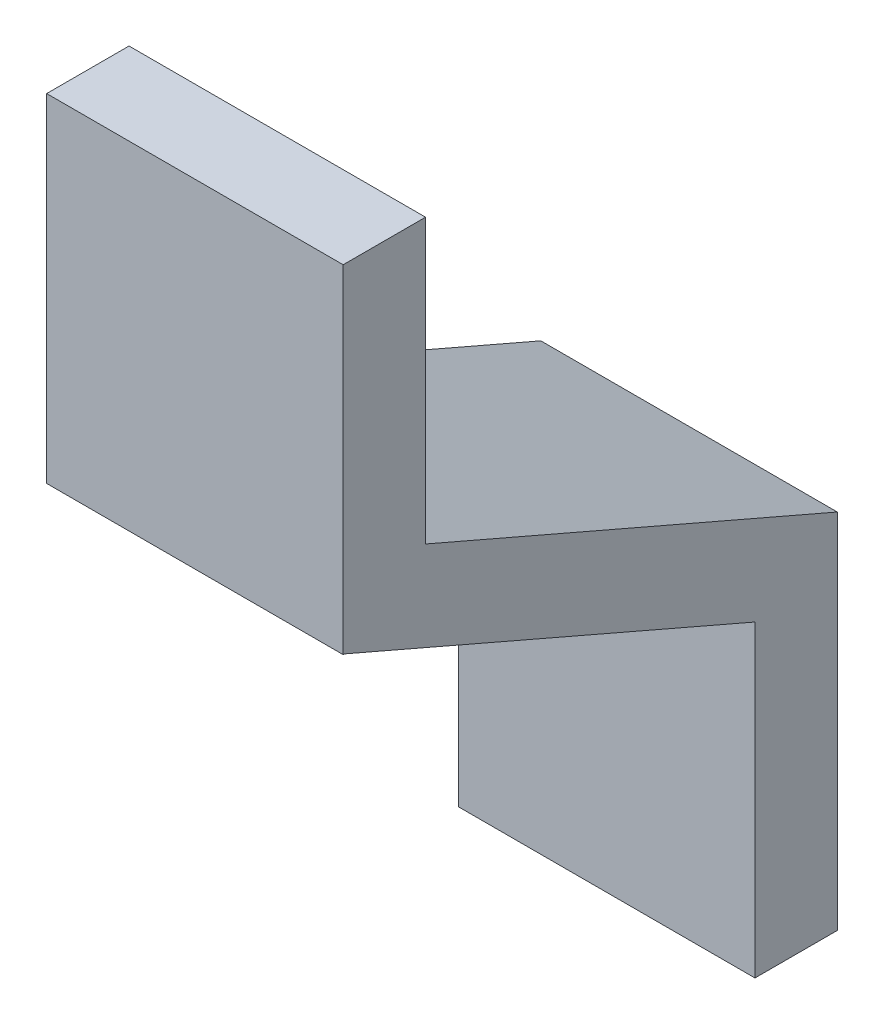
ISO-10303-21;
HEADER;
FILE_DESCRIPTION(('STEP AP214'),'2;1');
FILE_NAME('part.step','',(''),(''),'','','');
FILE_SCHEMA(('AUTOMOTIVE_DESIGN { 1 0 10303 214 1 1 1 1 }'));
ENDSEC;
DATA;
#1=APPLICATION_CONTEXT('core data for automotive mechanical design processes');
#2=APPLICATION_PROTOCOL_DEFINITION('international standard','automotive_design',2000,#1);
#3=PRODUCT_CONTEXT('',#1,'mechanical');
#4=PRODUCT('Part','Part','',(#3));
#5=PRODUCT_RELATED_PRODUCT_CATEGORY('part','',(#4));
#6=PRODUCT_DEFINITION_FORMATION('','',#4);
#7=PRODUCT_DEFINITION_CONTEXT('part definition',#1,'design');
#8=PRODUCT_DEFINITION('design','',#6,#7);
#9=PRODUCT_DEFINITION_SHAPE('','',#8);
#10=(LENGTH_UNIT() NAMED_UNIT(*) SI_UNIT(.MILLI.,.METRE.));
#11=(NAMED_UNIT(*) PLANE_ANGLE_UNIT() SI_UNIT($,.RADIAN.));
#12=(NAMED_UNIT(*) SI_UNIT($,.STERADIAN.) SOLID_ANGLE_UNIT());
#13=UNCERTAINTY_MEASURE_WITH_UNIT(LENGTH_MEASURE(1.E-05),#10,'distance_accuracy_value','');
#14=(GEOMETRIC_REPRESENTATION_CONTEXT(3) GLOBAL_UNCERTAINTY_ASSIGNED_CONTEXT((#13)) GLOBAL_UNIT_ASSIGNED_CONTEXT((#10,
#11,#12)) REPRESENTATION_CONTEXT('',''));
#15=CARTESIAN_POINT('',(0.,0.,0.));
#16=DIRECTION('',(0.,0.,1.));
#17=DIRECTION('',(1.,0.,0.));
#18=AXIS2_PLACEMENT_3D('',#15,#16,#17);
#19=CARTESIAN_POINT('',(9.02,0.999999996424,0.5));
#20=DIRECTION('',(0.,1.,0.));
#21=DIRECTION('',(0.,0.,1.));
#22=AXIS2_PLACEMENT_3D('',#19,#20,#21);
#23=PLANE('',#22);
#24=DIRECTION('',(1.,0.,0.));
#25=VECTOR('',#24,1.);
#26=CARTESIAN_POINT('',(9.02,0.999999996424,0.5));
#27=LINE('',#26,#25);
#28=CARTESIAN_POINT('',(9.380000014305,0.999999996424,0.5));
#29=VERTEX_POINT('',#28);
#30=CARTESIAN_POINT('',(9.02,0.999999996424,0.5));
#31=VERTEX_POINT('',#30);
#32=EDGE_CURVE('E140',#29,#31,#27,.F.);
#33=ORIENTED_EDGE('',*,*,#32,.T.);
#34=DIRECTION('',(0.,0.,-1.));
#35=VECTOR('',#34,1.);
#36=CARTESIAN_POINT('',(9.02,0.999999996424,0.));
#37=LINE('',#36,#35);
#38=CARTESIAN_POINT('',(9.02,0.999999996424,0.60000000149));
#39=VERTEX_POINT('',#38);
#40=EDGE_CURVE('E133',#31,#39,#37,.F.);
#41=ORIENTED_EDGE('',*,*,#40,.T.);
#42=DIRECTION('',(1.,0.,0.));
#43=VECTOR('',#42,1.);
#44=CARTESIAN_POINT('',(9.02,0.999999996424,0.60000000149));
#45=LINE('',#44,#43);
#46=CARTESIAN_POINT('',(9.380000014305,0.999999996424,0.60000000149));
#47=VERTEX_POINT('',#46);
#48=EDGE_CURVE('E129',#47,#39,#45,.F.);
#49=ORIENTED_EDGE('',*,*,#48,.F.);
#50=DIRECTION('',(0.,0.,-1.));
#51=VECTOR('',#50,1.);
#52=CARTESIAN_POINT('',(9.380000014305,0.999999996424,0.));
#53=LINE('',#52,#51);
#54=EDGE_CURVE('E106',#29,#47,#53,.F.);
#55=ORIENTED_EDGE('',*,*,#54,.F.);
#56=EDGE_LOOP('',(#33,#41,#49,#55));
#57=FACE_BOUND('',#56,.T.);
#58=ADVANCED_FACE('F17',(#57),#23,.T.);
#59=CARTESIAN_POINT('',(9.02,0.59,0.60000000149));
#60=DIRECTION('',(0.,0.,1.));
#61=DIRECTION('',(1.,0.,0.));
#62=AXIS2_PLACEMENT_3D('',#59,#60,#61);
#63=PLANE('',#62);
#64=DIRECTION('',(0.,1.,0.));
#65=VECTOR('',#64,1.);
#66=CARTESIAN_POINT('',(9.02,0.44,0.60000000149));
#67=LINE('',#66,#65);
#68=CARTESIAN_POINT('',(9.02,0.59,0.60000000149));
#69=VERTEX_POINT('',#68);
#70=EDGE_CURVE('E136',#39,#69,#67,.F.);
#71=ORIENTED_EDGE('',*,*,#70,.T.);
#72=DIRECTION('',(1.,0.,0.));
#73=VECTOR('',#72,1.);
#74=CARTESIAN_POINT('',(9.02,0.59,0.60000000149));
#75=LINE('',#74,#73);
#76=CARTESIAN_POINT('',(9.380000014305,0.59,0.60000000149));
#77=VERTEX_POINT('',#76);
#78=EDGE_CURVE('E92',#69,#77,#75,.T.);
#79=ORIENTED_EDGE('',*,*,#78,.T.);
#80=DIRECTION('',(0.,1.,0.));
#81=VECTOR('',#80,1.);
#82=CARTESIAN_POINT('',(9.380000014305,0.44,0.60000000149));
#83=LINE('',#82,#81);
#84=EDGE_CURVE('E73',#47,#77,#83,.F.);
#85=ORIENTED_EDGE('',*,*,#84,.F.);
#86=ORIENTED_EDGE('',*,*,#48,.T.);
#87=EDGE_LOOP('',(#71,#79,#85,#86));
#88=FACE_BOUND('',#87,.T.);
#89=ADVANCED_FACE('F285',(#88),#63,.T.);
#90=CARTESIAN_POINT('',(9.02,0.59,0.5));
#91=DIRECTION('',(0.,1.,0.));
#92=DIRECTION('',(0.,0.,1.));
#93=AXIS2_PLACEMENT_3D('',#90,#91,#92);
#94=PLANE('',#93);
#95=DIRECTION('',(1.,0.,0.));
#96=VECTOR('',#95,1.);
#97=CARTESIAN_POINT('',(9.02,0.590000000000416,0.59842599626982));
#98=LINE('',#97,#96);
#99=CARTESIAN_POINT('',(9.380000014305,0.590000000000104,0.598425996269911));
#100=VERTEX_POINT('',#99);
#101=CARTESIAN_POINT('',(9.02,0.590000000000104,0.59842599626991));
#102=VERTEX_POINT('',#101);
#103=EDGE_CURVE('E84',#100,#102,#98,.F.);
#104=ORIENTED_EDGE('',*,*,#103,.F.);
#105=DIRECTION('',(0.,0.,-1.));
#106=VECTOR('',#105,1.);
#107=CARTESIAN_POINT('',(9.380000014305,0.59,0.));
#108=LINE('',#107,#106);
#109=EDGE_CURVE('E20',#77,#100,#108,.T.);
#110=ORIENTED_EDGE('',*,*,#109,.F.);
#111=ORIENTED_EDGE('',*,*,#78,.F.);
#112=DIRECTION('',(0.,0.,1.));
#113=VECTOR('',#112,1.);
#114=CARTESIAN_POINT('',(9.02,0.59,0.5));
#115=LINE('',#114,#113);
#116=EDGE_CURVE('E87',#69,#102,#115,.F.);
#117=ORIENTED_EDGE('',*,*,#116,.T.);
#118=EDGE_LOOP('',(#104,#110,#111,#117));
#119=FACE_BOUND('',#118,.T.);
#120=ADVANCED_FACE('F85',(#119),#94,.F.);
#121=CARTESIAN_POINT('',(9.02,0.348224508223,0.03971472531736));
#122=DIRECTION('',(0.,-0.917754904098641,0.397147247255844));
#123=DIRECTION('',(0.,-0.397147247255844,-0.917754904098641));
#124=AXIS2_PLACEMENT_3D('',#121,#122,#123);
#125=PLANE('',#124);
#126=DIRECTION('',(0.,-0.397147247255413,-0.917754904098827));
#127=VECTOR('',#126,1.);
#128=CARTESIAN_POINT('',(9.380000014305,0.59,0.59842599627));
#129=LINE('',#128,#127);
#130=CARTESIAN_POINT('',(9.380000014305,0.37431222660502,0.10000000149));
#131=VERTEX_POINT('',#130);
#132=EDGE_CURVE('E80',#100,#131,#129,.T.);
#133=ORIENTED_EDGE('',*,*,#132,.F.);
#134=ORIENTED_EDGE('',*,*,#103,.T.);
#135=DIRECTION('',(0.,-0.397147247255413,-0.917754904098827));
#136=VECTOR('',#135,1.);
#137=CARTESIAN_POINT('',(9.02,0.59,0.59842599627));
#138=LINE('',#137,#136);
#139=CARTESIAN_POINT('',(9.02,0.374312226605,0.10000000149));
#140=VERTEX_POINT('',#139);
#141=EDGE_CURVE('E122',#102,#140,#138,.T.);
#142=ORIENTED_EDGE('',*,*,#141,.T.);
#143=DIRECTION('',(1.,0.,0.));
#144=VECTOR('',#143,1.);
#145=CARTESIAN_POINT('',(9.02,0.374312226605,0.10000000149));
#146=LINE('',#145,#144);
#147=EDGE_CURVE('E91',#131,#140,#146,.F.);
#148=ORIENTED_EDGE('',*,*,#147,.F.);
#149=EDGE_LOOP('',(#133,#134,#142,#148));
#150=FACE_BOUND('',#149,.T.);
#151=ADVANCED_FACE('F94',(#150),#125,.T.);
#152=CARTESIAN_POINT('',(9.02,0.,0.10000000149));
#153=DIRECTION('',(0.,0.,1.));
#154=DIRECTION('',(1.,0.,0.));
#155=AXIS2_PLACEMENT_3D('',#152,#153,#154);
#156=PLANE('',#155);
#157=ORIENTED_EDGE('',*,*,#147,.T.);
#158=DIRECTION('',(0.,1.,0.));
#159=VECTOR('',#158,1.);
#160=CARTESIAN_POINT('',(9.02,0.44,0.10000000149));
#161=LINE('',#160,#159);
#162=CARTESIAN_POINT('',(9.02,0.,0.10000000149));
#163=VERTEX_POINT('',#162);
#164=EDGE_CURVE('E118',#140,#163,#161,.F.);
#165=ORIENTED_EDGE('',*,*,#164,.T.);
#166=DIRECTION('',(1.,0.,0.));
#167=VECTOR('',#166,1.);
#168=CARTESIAN_POINT('',(9.02,0.,0.10000000149));
#169=LINE('',#168,#167);
#170=CARTESIAN_POINT('',(9.380000014305,0.,0.10000000149));
#171=VERTEX_POINT('',#170);
#172=EDGE_CURVE('E115',#163,#171,#169,.T.);
#173=ORIENTED_EDGE('',*,*,#172,.T.);
#174=DIRECTION('',(0.,1.,0.));
#175=VECTOR('',#174,1.);
#176=CARTESIAN_POINT('',(9.380000014305,0.44,0.10000000149));
#177=LINE('',#176,#175);
#178=EDGE_CURVE('E96',#131,#171,#177,.F.);
#179=ORIENTED_EDGE('',*,*,#178,.F.);
#180=EDGE_LOOP('',(#157,#165,#173,#179));
#181=FACE_BOUND('',#180,.T.);
#182=ADVANCED_FACE('F202',(#181),#156,.T.);
#183=CARTESIAN_POINT('',(9.02,0.,0.));
#184=DIRECTION('',(0.,1.,0.));
#185=DIRECTION('',(0.,0.,1.));
#186=AXIS2_PLACEMENT_3D('',#183,#184,#185);
#187=PLANE('',#186);
#188=DIRECTION('',(0.,0.,-1.));
#189=VECTOR('',#188,1.);
#190=CARTESIAN_POINT('',(9.02,0.,0.));
#191=LINE('',#190,#189);
#192=CARTESIAN_POINT('',(9.02,0.,0.));
#193=VERTEX_POINT('',#192);
#194=EDGE_CURVE('E121',#163,#193,#191,.T.);
#195=ORIENTED_EDGE('',*,*,#194,.T.);
#196=DIRECTION('',(1.,0.,0.));
#197=VECTOR('',#196,1.);
#198=CARTESIAN_POINT('',(9.02,0.,0.));
#199=LINE('',#198,#197);
#200=CARTESIAN_POINT('',(9.380000014305,0.,0.));
#201=VERTEX_POINT('',#200);
#202=EDGE_CURVE('E112',#193,#201,#199,.T.);
#203=ORIENTED_EDGE('',*,*,#202,.T.);
#204=DIRECTION('',(0.,0.,-1.));
#205=VECTOR('',#204,1.);
#206=CARTESIAN_POINT('',(9.380000014305,0.,0.));
#207=LINE('',#206,#205);
#208=EDGE_CURVE('E98',#171,#201,#207,.T.);
#209=ORIENTED_EDGE('',*,*,#208,.F.);
#210=ORIENTED_EDGE('',*,*,#172,.F.);
#211=EDGE_LOOP('',(#195,#203,#209,#210));
#212=FACE_BOUND('',#211,.T.);
#213=ADVANCED_FACE('F206',(#212),#187,.F.);
#214=CARTESIAN_POINT('',(9.02,0.,0.));
#215=DIRECTION('',(0.,0.,1.));
#216=DIRECTION('',(1.,0.,0.));
#217=AXIS2_PLACEMENT_3D('',#214,#215,#216);
#218=PLANE('',#217);
#219=ORIENTED_EDGE('',*,*,#202,.F.);
#220=DIRECTION('',(0.,1.,0.));
#221=VECTOR('',#220,1.);
#222=CARTESIAN_POINT('',(9.02,0.44,0.));
#223=LINE('',#222,#221);
#224=CARTESIAN_POINT('',(9.02,0.439999998997445,-1.94673175919965E-10));
#225=VERTEX_POINT('',#224);
#226=EDGE_CURVE('E178',#193,#225,#223,.T.);
#227=ORIENTED_EDGE('',*,*,#226,.T.);
#228=DIRECTION('',(1.,0.,0.));
#229=VECTOR('',#228,1.);
#230=CARTESIAN_POINT('',(9.02,0.43999999966303,-7.78692710220355E-10));
#231=LINE('',#230,#229);
#232=CARTESIAN_POINT('',(9.380000014305,0.439999998997445,-1.94673175919965E-10));
#233=VERTEX_POINT('',#232);
#234=EDGE_CURVE('E163',#225,#233,#231,.T.);
#235=ORIENTED_EDGE('',*,*,#234,.T.);
#236=DIRECTION('',(0.,1.,0.));
#237=VECTOR('',#236,1.);
#238=CARTESIAN_POINT('',(9.380000014305,0.44,0.));
#239=LINE('',#238,#237);
#240=EDGE_CURVE('E109',#201,#233,#239,.T.);
#241=ORIENTED_EDGE('',*,*,#240,.F.);
#242=EDGE_LOOP('',(#219,#227,#235,#241));
#243=FACE_BOUND('',#242,.T.);
#244=ADVANCED_FACE('F186',(#243),#218,.F.);
#245=CARTESIAN_POINT('',(9.380000014305,0.44,0.));
#246=DIRECTION('',(1.,0.,0.));
#247=DIRECTION('',(0.,0.,-1.));
#248=AXIS2_PLACEMENT_3D('',#245,#246,#247);
#249=PLANE('',#248);
#250=ORIENTED_EDGE('',*,*,#178,.T.);
#251=ORIENTED_EDGE('',*,*,#208,.T.);
#252=ORIENTED_EDGE('',*,*,#240,.T.);
#253=DIRECTION('',(0.,-0.397147247255844,-0.917754904098641));
#254=VECTOR('',#253,1.);
#255=CARTESIAN_POINT('',(9.380000014305,0.44,0.));
#256=LINE('',#255,#254);
#257=CARTESIAN_POINT('',(9.380000014305,0.656368904967003,0.499999999999999));
#258=VERTEX_POINT('',#257);
#259=EDGE_CURVE('E151',#233,#258,#256,.F.);
#260=ORIENTED_EDGE('',*,*,#259,.T.);
#261=DIRECTION('',(0.,1.,0.));
#262=VECTOR('',#261,1.);
#263=CARTESIAN_POINT('',(9.380000014305,0.59,0.5));
#264=LINE('',#263,#262);
#265=EDGE_CURVE('E144',#258,#29,#264,.T.);
#266=ORIENTED_EDGE('',*,*,#265,.T.);
#267=ORIENTED_EDGE('',*,*,#54,.T.);
#268=ORIENTED_EDGE('',*,*,#84,.T.);
#269=ORIENTED_EDGE('',*,*,#109,.T.);
#270=ORIENTED_EDGE('',*,*,#132,.T.);
#271=EDGE_LOOP('',(#250,#251,#252,#260,#266,#267,#268,#269,#270));
#272=FACE_BOUND('',#271,.T.);
#273=ADVANCED_FACE('F78',(#272),#249,.T.);
#274=CARTESIAN_POINT('',(9.02,0.59,0.5));
#275=DIRECTION('',(0.,0.,1.));
#276=DIRECTION('',(1.,0.,0.));
#277=AXIS2_PLACEMENT_3D('',#274,#275,#276);
#278=PLANE('',#277);
#279=ORIENTED_EDGE('',*,*,#265,.F.);
#280=DIRECTION('',(1.,0.,0.));
#281=VECTOR('',#280,1.);
#282=CARTESIAN_POINT('',(9.02,0.656368904967005,0.499999999999998));
#283=LINE('',#282,#281);
#284=CARTESIAN_POINT('',(9.02,0.656368904967001,0.5));
#285=VERTEX_POINT('',#284);
#286=EDGE_CURVE('E26',#258,#285,#283,.F.);
#287=ORIENTED_EDGE('',*,*,#286,.T.);
#288=DIRECTION('',(0.,1.,0.));
#289=VECTOR('',#288,1.);
#290=CARTESIAN_POINT('',(9.02,0.44,0.5));
#291=LINE('',#290,#289);
#292=EDGE_CURVE('E34',#285,#31,#291,.T.);
#293=ORIENTED_EDGE('',*,*,#292,.T.);
#294=ORIENTED_EDGE('',*,*,#32,.F.);
#295=EDGE_LOOP('',(#279,#287,#293,#294));
#296=FACE_BOUND('',#295,.T.);
#297=ADVANCED_FACE('F212',(#296),#278,.F.);
#298=CARTESIAN_POINT('',(9.02,0.44,0.));
#299=DIRECTION('',(1.,0.,0.));
#300=DIRECTION('',(0.,0.,-1.));
#301=AXIS2_PLACEMENT_3D('',#298,#299,#300);
#302=PLANE('',#301);
#303=ORIENTED_EDGE('',*,*,#226,.F.);
#304=ORIENTED_EDGE('',*,*,#194,.F.);
#305=ORIENTED_EDGE('',*,*,#164,.F.);
#306=ORIENTED_EDGE('',*,*,#141,.F.);
#307=ORIENTED_EDGE('',*,*,#116,.F.);
#308=ORIENTED_EDGE('',*,*,#70,.F.);
#309=ORIENTED_EDGE('',*,*,#40,.F.);
#310=ORIENTED_EDGE('',*,*,#292,.F.);
#311=DIRECTION('',(0.,-0.397147247255844,-0.917754904098641));
#312=VECTOR('',#311,1.);
#313=CARTESIAN_POINT('',(9.02,0.44,0.));
#314=LINE('',#313,#312);
#315=EDGE_CURVE('E11',#285,#225,#314,.T.);
#316=ORIENTED_EDGE('',*,*,#315,.T.);
#317=EDGE_LOOP('',(#303,#304,#305,#306,#307,#308,#309,#310,#316));
#318=FACE_BOUND('',#317,.T.);
#319=ADVANCED_FACE('F207',(#318),#302,.F.);
#320=CARTESIAN_POINT('',(9.02,0.44,0.));
#321=DIRECTION('',(0.,-0.917754904098641,0.397147247255844));
#322=DIRECTION('',(0.,-0.397147247255844,-0.917754904098641));
#323=AXIS2_PLACEMENT_3D('',#320,#321,#322);
#324=PLANE('',#323);
#325=ORIENTED_EDGE('',*,*,#286,.F.);
#326=ORIENTED_EDGE('',*,*,#259,.F.);
#327=ORIENTED_EDGE('',*,*,#234,.F.);
#328=ORIENTED_EDGE('',*,*,#315,.F.);
#329=EDGE_LOOP('',(#325,#326,#327,#328));
#330=FACE_BOUND('',#329,.T.);
#331=ADVANCED_FACE('F193',(#330),#324,.F.);
#332=CLOSED_SHELL('',(#58,#89,#120,#151,#182,#213,#244,#273,#297,#319,#331));
#333=MANIFOLD_SOLID_BREP('B1',#332);
#334=ADVANCED_BREP_SHAPE_REPRESENTATION('',(#18,#333),#14);
#335=SHAPE_DEFINITION_REPRESENTATION(#9,#334);
ENDSEC;
END-ISO-10303-21;
